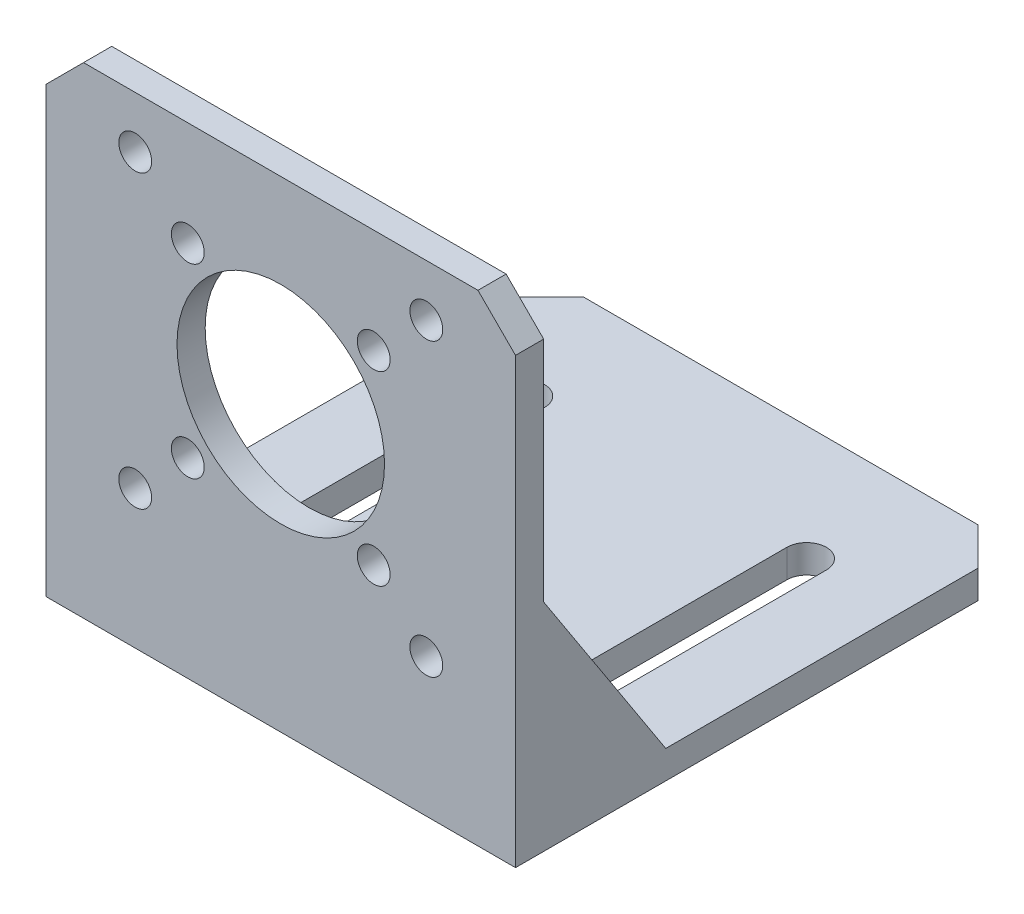
ISO-10303-21;
HEADER;
FILE_DESCRIPTION(('STEP AP214'),'2;1');
FILE_NAME('part.step','',(''),(''),'','','');
FILE_SCHEMA(('AUTOMOTIVE_DESIGN { 1 0 10303 214 1 1 1 1 }'));
ENDSEC;
DATA;
#1=APPLICATION_CONTEXT('core data for automotive mechanical design processes');
#2=APPLICATION_PROTOCOL_DEFINITION('international standard','automotive_design',2000,#1);
#3=PRODUCT_CONTEXT('',#1,'mechanical');
#4=PRODUCT('Part','Part','',(#3));
#5=PRODUCT_RELATED_PRODUCT_CATEGORY('part','',(#4));
#6=PRODUCT_DEFINITION_FORMATION('','',#4);
#7=PRODUCT_DEFINITION_CONTEXT('part definition',#1,'design');
#8=PRODUCT_DEFINITION('design','',#6,#7);
#9=PRODUCT_DEFINITION_SHAPE('','',#8);
#10=(LENGTH_UNIT() NAMED_UNIT(*) SI_UNIT(.MILLI.,.METRE.));
#11=(NAMED_UNIT(*) PLANE_ANGLE_UNIT() SI_UNIT($,.RADIAN.));
#12=(NAMED_UNIT(*) SI_UNIT($,.STERADIAN.) SOLID_ANGLE_UNIT());
#13=UNCERTAINTY_MEASURE_WITH_UNIT(LENGTH_MEASURE(1.E-05),#10,'distance_accuracy_value','');
#14=(GEOMETRIC_REPRESENTATION_CONTEXT(3) GLOBAL_UNCERTAINTY_ASSIGNED_CONTEXT((#13)) GLOBAL_UNIT_ASSIGNED_CONTEXT((#10,
#11,#12)) REPRESENTATION_CONTEXT('',''));
#15=CARTESIAN_POINT('',(0.,0.,0.));
#16=DIRECTION('',(0.,0.,1.));
#17=DIRECTION('',(1.,0.,0.));
#18=AXIS2_PLACEMENT_3D('',#15,#16,#17);
#19=CARTESIAN_POINT('',(25.,5.,-5.));
#20=DIRECTION('',(1.,0.,0.));
#21=DIRECTION('',(0.,0.,-1.));
#22=AXIS2_PLACEMENT_3D('',#19,#20,#21);
#23=CYLINDRICAL_SURFACE('',#22,2.);
#24=CARTESIAN_POINT('',(-22.,5.,-5.));
#25=DIRECTION('',(-1.,0.,0.));
#26=DIRECTION('',(0.,0.,1.));
#27=AXIS2_PLACEMENT_3D('',#24,#25,#26);
#28=CIRCLE('',#27,2.);
#29=CARTESIAN_POINT('',(-22.,5.,-3.));
#30=VERTEX_POINT('',#29);
#31=CARTESIAN_POINT('',(-22.,3.,-5.));
#32=VERTEX_POINT('',#31);
#33=EDGE_CURVE('E473',#30,#32,#28,.F.);
#34=ORIENTED_EDGE('',*,*,#33,.F.);
#35=DIRECTION('',(-1.,0.,0.));
#36=VECTOR('',#35,1.);
#37=CARTESIAN_POINT('',(-25.,5.,-3.));
#38=LINE('',#37,#36);
#39=CARTESIAN_POINT('',(22.,5.,-3.));
#40=VERTEX_POINT('',#39);
#41=EDGE_CURVE('E297',#40,#30,#38,.T.);
#42=ORIENTED_EDGE('',*,*,#41,.F.);
#43=CARTESIAN_POINT('',(22.,5.,-5.));
#44=DIRECTION('',(1.,0.,0.));
#45=DIRECTION('',(0.,0.,-1.));
#46=AXIS2_PLACEMENT_3D('',#43,#44,#45);
#47=CIRCLE('',#46,2.);
#48=CARTESIAN_POINT('',(22.,3.,-5.));
#49=VERTEX_POINT('',#48);
#50=EDGE_CURVE('E11',#49,#40,#47,.F.);
#51=ORIENTED_EDGE('',*,*,#50,.F.);
#52=DIRECTION('',(-1.,0.,0.));
#53=VECTOR('',#52,1.);
#54=CARTESIAN_POINT('',(25.,3.,-5.));
#55=LINE('',#54,#53);
#56=EDGE_CURVE('E42',#32,#49,#55,.F.);
#57=ORIENTED_EDGE('',*,*,#56,.F.);
#58=EDGE_LOOP('',(#34,#42,#51,#57));
#59=FACE_BOUND('',#58,.T.);
#60=ADVANCED_FACE('F35',(#59),#23,.F.);
#61=CARTESIAN_POINT('',(25.,0.,0.));
#62=DIRECTION('',(0.,1.,0.));
#63=DIRECTION('',(0.,0.,1.));
#64=AXIS2_PLACEMENT_3D('',#61,#62,#63);
#65=PLANE('',#64);
#66=DIRECTION('',(0.,0.,-1.));
#67=VECTOR('',#66,1.);
#68=CARTESIAN_POINT('',(-25.,0.,0.));
#69=LINE('',#68,#67);
#70=CARTESIAN_POINT('',(-25.,0.,0.));
#71=VERTEX_POINT('',#70);
#72=CARTESIAN_POINT('',(-25.,0.,-49.25));
#73=VERTEX_POINT('',#72);
#74=EDGE_CURVE('E218',#71,#73,#69,.T.);
#75=ORIENTED_EDGE('',*,*,#74,.T.);
#76=DIRECTION('',(-0.707106781186546,0.,0.707106781186549));
#77=VECTOR('',#76,1.);
#78=CARTESIAN_POINT('',(-25.,0.,-49.25));
#79=LINE('',#78,#77);
#80=CARTESIAN_POINT('',(-21.,0.,-53.25));
#81=VERTEX_POINT('',#80);
#82=EDGE_CURVE('E242',#73,#81,#79,.F.);
#83=ORIENTED_EDGE('',*,*,#82,.T.);
#84=DIRECTION('',(-1.,0.,0.));
#85=VECTOR('',#84,1.);
#86=CARTESIAN_POINT('',(25.,0.,-53.25));
#87=LINE('',#86,#85);
#88=CARTESIAN_POINT('',(21.,0.,-53.25));
#89=VERTEX_POINT('',#88);
#90=EDGE_CURVE('E234',#89,#81,#87,.T.);
#91=ORIENTED_EDGE('',*,*,#90,.F.);
#92=DIRECTION('',(0.707106781186549,0.,0.707106781186546));
#93=VECTOR('',#92,1.);
#94=CARTESIAN_POINT('',(21.,0.,-53.25));
#95=LINE('',#94,#93);
#96=CARTESIAN_POINT('',(25.,0.,-49.25));
#97=VERTEX_POINT('',#96);
#98=EDGE_CURVE('E244',#89,#97,#95,.T.);
#99=ORIENTED_EDGE('',*,*,#98,.T.);
#100=DIRECTION('',(0.,0.,-1.));
#101=VECTOR('',#100,1.);
#102=CARTESIAN_POINT('',(25.,0.,0.));
#103=LINE('',#102,#101);
#104=CARTESIAN_POINT('',(25.,0.,0.));
#105=VERTEX_POINT('',#104);
#106=EDGE_CURVE('E216',#105,#97,#103,.T.);
#107=ORIENTED_EDGE('',*,*,#106,.F.);
#108=DIRECTION('',(-1.,0.,0.));
#109=VECTOR('',#108,1.);
#110=CARTESIAN_POINT('',(25.,0.,0.));
#111=LINE('',#110,#109);
#112=EDGE_CURVE('E222',#105,#71,#111,.T.);
#113=ORIENTED_EDGE('',*,*,#112,.T.);
#114=EDGE_LOOP('',(#75,#83,#91,#99,#107,#113));
#115=FACE_BOUND('',#114,.T.);
#116=CARTESIAN_POINT('',(15.,0.,-41.));
#117=DIRECTION('',(0.,1.,0.));
#118=DIRECTION('',(0.,0.,-1.));
#119=AXIS2_PLACEMENT_3D('',#116,#117,#118);
#120=CIRCLE('',#119,2.1);
#121=CARTESIAN_POINT('',(17.1,0.,-41.));
#122=VERTEX_POINT('',#121);
#123=CARTESIAN_POINT('',(12.9,0.,-41.));
#124=VERTEX_POINT('',#123);
#125=EDGE_CURVE('E324',#122,#124,#120,.T.);
#126=ORIENTED_EDGE('',*,*,#125,.T.);
#127=DIRECTION('',(0.,0.,1.));
#128=VECTOR('',#127,1.);
#129=CARTESIAN_POINT('',(12.9,0.,-41.));
#130=LINE('',#129,#128);
#131=CARTESIAN_POINT('',(12.9,0.,-11.));
#132=VERTEX_POINT('',#131);
#133=EDGE_CURVE('E350',#124,#132,#130,.T.);
#134=ORIENTED_EDGE('',*,*,#133,.T.);
#135=CARTESIAN_POINT('',(15.,0.,-11.));
#136=DIRECTION('',(0.,1.,0.));
#137=DIRECTION('',(0.,0.,-1.));
#138=AXIS2_PLACEMENT_3D('',#135,#136,#137);
#139=CIRCLE('',#138,2.1);
#140=CARTESIAN_POINT('',(17.1,0.,-11.));
#141=VERTEX_POINT('',#140);
#142=EDGE_CURVE('E353',#132,#141,#139,.T.);
#143=ORIENTED_EDGE('',*,*,#142,.T.);
#144=DIRECTION('',(0.,0.,-1.));
#145=VECTOR('',#144,1.);
#146=CARTESIAN_POINT('',(17.1,0.,-41.));
#147=LINE('',#146,#145);
#148=EDGE_CURVE('E356',#141,#122,#147,.T.);
#149=ORIENTED_EDGE('',*,*,#148,.T.);
#150=EDGE_LOOP('',(#126,#134,#143,#149));
#151=FACE_BOUND('',#150,.T.);
#152=CARTESIAN_POINT('',(-15.,0.,-41.));
#153=DIRECTION('',(0.,1.,0.));
#154=DIRECTION('',(0.,0.,1.));
#155=AXIS2_PLACEMENT_3D('',#152,#153,#154);
#156=CIRCLE('',#155,2.1);
#157=CARTESIAN_POINT('',(-12.9,0.,-41.));
#158=VERTEX_POINT('',#157);
#159=CARTESIAN_POINT('',(-17.1,0.,-41.));
#160=VERTEX_POINT('',#159);
#161=EDGE_CURVE('E325',#158,#160,#156,.T.);
#162=ORIENTED_EDGE('',*,*,#161,.T.);
#163=DIRECTION('',(0.,0.,1.));
#164=VECTOR('',#163,1.);
#165=CARTESIAN_POINT('',(-17.1,0.,-41.));
#166=LINE('',#165,#164);
#167=CARTESIAN_POINT('',(-17.1,0.,-11.));
#168=VERTEX_POINT('',#167);
#169=EDGE_CURVE('E328',#160,#168,#166,.T.);
#170=ORIENTED_EDGE('',*,*,#169,.T.);
#171=CARTESIAN_POINT('',(-15.,0.,-11.));
#172=DIRECTION('',(0.,1.,0.));
#173=DIRECTION('',(0.,0.,1.));
#174=AXIS2_PLACEMENT_3D('',#171,#172,#173);
#175=CIRCLE('',#174,2.1);
#176=CARTESIAN_POINT('',(-12.9,0.,-11.));
#177=VERTEX_POINT('',#176);
#178=EDGE_CURVE('E332',#168,#177,#175,.T.);
#179=ORIENTED_EDGE('',*,*,#178,.T.);
#180=DIRECTION('',(0.,0.,-1.));
#181=VECTOR('',#180,1.);
#182=CARTESIAN_POINT('',(-12.9,0.,-41.));
#183=LINE('',#182,#181);
#184=EDGE_CURVE('E335',#177,#158,#183,.T.);
#185=ORIENTED_EDGE('',*,*,#184,.T.);
#186=EDGE_LOOP('',(#162,#170,#179,#185));
#187=FACE_BOUND('',#186,.T.);
#188=ADVANCED_FACE('F428',(#115,#151,#187),#65,.F.);
#189=CARTESIAN_POINT('',(25.,3.,0.));
#190=DIRECTION('',(0.,1.,0.));
#191=DIRECTION('',(0.,0.,1.));
#192=AXIS2_PLACEMENT_3D('',#189,#190,#191);
#193=PLANE('',#192);
#194=DIRECTION('',(-1.,0.,0.));
#195=VECTOR('',#194,1.);
#196=CARTESIAN_POINT('',(25.,3.,-16.));
#197=LINE('',#196,#195);
#198=CARTESIAN_POINT('',(-22.,3.,-16.));
#199=VERTEX_POINT('',#198);
#200=CARTESIAN_POINT('',(-25.,3.,-16.));
#201=VERTEX_POINT('',#200);
#202=EDGE_CURVE('E193',#199,#201,#197,.T.);
#203=ORIENTED_EDGE('',*,*,#202,.F.);
#204=DIRECTION('',(0.,0.,1.));
#205=VECTOR('',#204,1.);
#206=CARTESIAN_POINT('',(-22.,3.,0.));
#207=LINE('',#206,#205);
#208=EDGE_CURVE('E303',#199,#32,#207,.T.);
#209=ORIENTED_EDGE('',*,*,#208,.T.);
#210=ORIENTED_EDGE('',*,*,#56,.T.);
#211=DIRECTION('',(0.,0.,-1.));
#212=VECTOR('',#211,1.);
#213=CARTESIAN_POINT('',(22.,3.,0.));
#214=LINE('',#213,#212);
#215=CARTESIAN_POINT('',(22.,3.,-16.));
#216=VERTEX_POINT('',#215);
#217=EDGE_CURVE('E57',#49,#216,#214,.T.);
#218=ORIENTED_EDGE('',*,*,#217,.T.);
#219=DIRECTION('',(1.,0.,0.));
#220=VECTOR('',#219,1.);
#221=CARTESIAN_POINT('',(25.,3.,-16.));
#222=LINE('',#221,#220);
#223=CARTESIAN_POINT('',(25.,3.,-16.));
#224=VERTEX_POINT('',#223);
#225=EDGE_CURVE('E317',#224,#216,#222,.F.);
#226=ORIENTED_EDGE('',*,*,#225,.F.);
#227=DIRECTION('',(0.,0.,-1.));
#228=VECTOR('',#227,1.);
#229=CARTESIAN_POINT('',(25.,3.,0.));
#230=LINE('',#229,#228);
#231=CARTESIAN_POINT('',(25.,3.,-49.25));
#232=VERTEX_POINT('',#231);
#233=EDGE_CURVE('E421',#224,#232,#230,.T.);
#234=ORIENTED_EDGE('',*,*,#233,.T.);
#235=DIRECTION('',(-0.707106781186549,0.,-0.707106781186546));
#236=VECTOR('',#235,1.);
#237=CARTESIAN_POINT('',(49.625,3.,-24.6250000000001));
#238=LINE('',#237,#236);
#239=CARTESIAN_POINT('',(21.,3.,-53.25));
#240=VERTEX_POINT('',#239);
#241=EDGE_CURVE('E255',#232,#240,#238,.T.);
#242=ORIENTED_EDGE('',*,*,#241,.T.);
#243=DIRECTION('',(-1.,0.,0.));
#244=VECTOR('',#243,1.);
#245=CARTESIAN_POINT('',(25.,3.,-53.25));
#246=LINE('',#245,#244);
#247=CARTESIAN_POINT('',(-21.,3.,-53.25));
#248=VERTEX_POINT('',#247);
#249=EDGE_CURVE('E231',#240,#248,#246,.T.);
#250=ORIENTED_EDGE('',*,*,#249,.T.);
#251=DIRECTION('',(0.707106781186546,0.,-0.707106781186549));
#252=VECTOR('',#251,1.);
#253=CARTESIAN_POINT('',(-24.6250000000001,3.,-49.6249999999999));
#254=LINE('',#253,#252);
#255=CARTESIAN_POINT('',(-25.,3.,-49.25));
#256=VERTEX_POINT('',#255);
#257=EDGE_CURVE('E252',#248,#256,#254,.F.);
#258=ORIENTED_EDGE('',*,*,#257,.T.);
#259=DIRECTION('',(0.,0.,-1.));
#260=VECTOR('',#259,1.);
#261=CARTESIAN_POINT('',(-25.,3.,0.));
#262=LINE('',#261,#260);
#263=EDGE_CURVE('E213',#201,#256,#262,.T.);
#264=ORIENTED_EDGE('',*,*,#263,.F.);
#265=EDGE_LOOP('',(#203,#209,#210,#218,#226,#234,#242,#250,#258,#264));
#266=FACE_BOUND('',#265,.T.);
#267=DIRECTION('',(0.,0.,-1.));
#268=VECTOR('',#267,1.);
#269=CARTESIAN_POINT('',(12.9,3.,0.));
#270=LINE('',#269,#268);
#271=CARTESIAN_POINT('',(12.9,3.00000000000002,-11.));
#272=VERTEX_POINT('',#271);
#273=CARTESIAN_POINT('',(12.9,3.00000000000002,-41.));
#274=VERTEX_POINT('',#273);
#275=EDGE_CURVE('E279',#272,#274,#270,.T.);
#276=ORIENTED_EDGE('',*,*,#275,.T.);
#277=CARTESIAN_POINT('',(15.,3.,-41.));
#278=DIRECTION('',(0.,1.,0.));
#279=DIRECTION('',(0.,0.,1.));
#280=AXIS2_PLACEMENT_3D('',#277,#278,#279);
#281=CIRCLE('',#280,2.1);
#282=CARTESIAN_POINT('',(17.1,3.00000000000002,-41.));
#283=VERTEX_POINT('',#282);
#284=EDGE_CURVE('E282',#274,#283,#281,.F.);
#285=ORIENTED_EDGE('',*,*,#284,.T.);
#286=DIRECTION('',(0.,0.,1.));
#287=VECTOR('',#286,1.);
#288=CARTESIAN_POINT('',(17.1,3.,0.));
#289=LINE('',#288,#287);
#290=CARTESIAN_POINT('',(17.1,3.,-11.));
#291=VERTEX_POINT('',#290);
#292=EDGE_CURVE('E273',#283,#291,#289,.T.);
#293=ORIENTED_EDGE('',*,*,#292,.T.);
#294=CARTESIAN_POINT('',(15.,3.,-11.));
#295=DIRECTION('',(0.,1.,0.));
#296=DIRECTION('',(0.,0.,1.));
#297=AXIS2_PLACEMENT_3D('',#294,#295,#296);
#298=CIRCLE('',#297,2.1);
#299=EDGE_CURVE('E276',#291,#272,#298,.F.);
#300=ORIENTED_EDGE('',*,*,#299,.T.);
#301=EDGE_LOOP('',(#276,#285,#293,#300));
#302=FACE_BOUND('',#301,.T.);
#303=DIRECTION('',(0.,0.,-1.));
#304=VECTOR('',#303,1.);
#305=CARTESIAN_POINT('',(-17.1,3.,0.));
#306=LINE('',#305,#304);
#307=CARTESIAN_POINT('',(-17.1,3.00000000000002,-11.));
#308=VERTEX_POINT('',#307);
#309=CARTESIAN_POINT('',(-17.1,3.00000000000002,-41.));
#310=VERTEX_POINT('',#309);
#311=EDGE_CURVE('E291',#308,#310,#306,.T.);
#312=ORIENTED_EDGE('',*,*,#311,.T.);
#313=CARTESIAN_POINT('',(-15.,3.,-41.));
#314=DIRECTION('',(0.,1.,0.));
#315=DIRECTION('',(0.,0.,1.));
#316=AXIS2_PLACEMENT_3D('',#313,#314,#315);
#317=CIRCLE('',#316,2.1);
#318=CARTESIAN_POINT('',(-12.9,3.00000000000002,-41.));
#319=VERTEX_POINT('',#318);
#320=EDGE_CURVE('E294',#310,#319,#317,.F.);
#321=ORIENTED_EDGE('',*,*,#320,.T.);
#322=DIRECTION('',(0.,0.,1.));
#323=VECTOR('',#322,1.);
#324=CARTESIAN_POINT('',(-12.9,3.,0.));
#325=LINE('',#324,#323);
#326=CARTESIAN_POINT('',(-12.9,3.,-11.));
#327=VERTEX_POINT('',#326);
#328=EDGE_CURVE('E285',#319,#327,#325,.T.);
#329=ORIENTED_EDGE('',*,*,#328,.T.);
#330=CARTESIAN_POINT('',(-15.,3.,-11.));
#331=DIRECTION('',(0.,1.,0.));
#332=DIRECTION('',(0.,0.,1.));
#333=AXIS2_PLACEMENT_3D('',#330,#331,#332);
#334=CIRCLE('',#333,2.1);
#335=EDGE_CURVE('E288',#327,#308,#334,.F.);
#336=ORIENTED_EDGE('',*,*,#335,.T.);
#337=EDGE_LOOP('',(#312,#321,#329,#336));
#338=FACE_BOUND('',#337,.T.);
#339=ADVANCED_FACE('F301',(#266,#302,#338),#193,.T.);
#340=CARTESIAN_POINT('',(25.,3.,-53.25));
#341=DIRECTION('',(0.,0.,-1.));
#342=DIRECTION('',(-1.,0.,0.));
#343=AXIS2_PLACEMENT_3D('',#340,#341,#342);
#344=PLANE('',#343);
#345=ORIENTED_EDGE('',*,*,#249,.F.);
#346=DIRECTION('',(0.,-1.,0.));
#347=VECTOR('',#346,1.);
#348=CARTESIAN_POINT('',(21.,0.,-53.25));
#349=LINE('',#348,#347);
#350=EDGE_CURVE('E239',#240,#89,#349,.T.);
#351=ORIENTED_EDGE('',*,*,#350,.T.);
#352=ORIENTED_EDGE('',*,*,#90,.T.);
#353=DIRECTION('',(0.,1.,0.));
#354=VECTOR('',#353,1.);
#355=CARTESIAN_POINT('',(-21.,3.,-53.25));
#356=LINE('',#355,#354);
#357=EDGE_CURVE('E237',#81,#248,#356,.T.);
#358=ORIENTED_EDGE('',*,*,#357,.T.);
#359=EDGE_LOOP('',(#345,#351,#352,#358));
#360=FACE_BOUND('',#359,.T.);
#361=ADVANCED_FACE('F442',(#360),#344,.T.);
#362=CARTESIAN_POINT('',(25.,51.25,-3.));
#363=DIRECTION('',(0.,0.,-1.));
#364=DIRECTION('',(0.,1.,0.));
#365=AXIS2_PLACEMENT_3D('',#362,#363,#364);
#366=PLANE('',#365);
#367=DIRECTION('',(1.,0.,0.));
#368=VECTOR('',#367,1.);
#369=CARTESIAN_POINT('',(25.,23.,-3.));
#370=LINE('',#369,#368);
#371=CARTESIAN_POINT('',(-25.,23.,-3.00000000000001));
#372=VERTEX_POINT('',#371);
#373=CARTESIAN_POINT('',(-22.,23.,-3.));
#374=VERTEX_POINT('',#373);
#375=EDGE_CURVE('E190',#372,#374,#370,.T.);
#376=ORIENTED_EDGE('',*,*,#375,.F.);
#377=DIRECTION('',(0.,-1.,0.));
#378=VECTOR('',#377,1.);
#379=CARTESIAN_POINT('',(-25.,51.25,-3.));
#380=LINE('',#379,#378);
#381=CARTESIAN_POINT('',(-25.,47.25,-3.));
#382=VERTEX_POINT('',#381);
#383=EDGE_CURVE('E202',#382,#372,#380,.T.);
#384=ORIENTED_EDGE('',*,*,#383,.F.);
#385=DIRECTION('',(-0.707106781186546,-0.707106781186549,0.));
#386=VECTOR('',#385,1.);
#387=CARTESIAN_POINT('',(1.99999999999991,74.25,-3.));
#388=LINE('',#387,#386);
#389=CARTESIAN_POINT('',(-21.,51.25,-3.));
#390=VERTEX_POINT('',#389);
#391=EDGE_CURVE('E262',#382,#390,#388,.F.);
#392=ORIENTED_EDGE('',*,*,#391,.T.);
#393=DIRECTION('',(-1.,0.,0.));
#394=VECTOR('',#393,1.);
#395=CARTESIAN_POINT('',(25.,51.25,-3.));
#396=LINE('',#395,#394);
#397=CARTESIAN_POINT('',(21.,51.25,-3.));
#398=VERTEX_POINT('',#397);
#399=EDGE_CURVE('E228',#398,#390,#396,.T.);
#400=ORIENTED_EDGE('',*,*,#399,.F.);
#401=DIRECTION('',(0.707106781186549,-0.707106781186546,0.));
#402=VECTOR('',#401,1.);
#403=CARTESIAN_POINT('',(23.,49.25,-3.));
#404=LINE('',#403,#402);
#405=CARTESIAN_POINT('',(25.,47.25,-3.));
#406=VERTEX_POINT('',#405);
#407=EDGE_CURVE('E260',#398,#406,#404,.T.);
#408=ORIENTED_EDGE('',*,*,#407,.T.);
#409=DIRECTION('',(0.,-1.,0.));
#410=VECTOR('',#409,1.);
#411=CARTESIAN_POINT('',(25.,51.25,-3.));
#412=LINE('',#411,#410);
#413=CARTESIAN_POINT('',(25.,23.,-3.00000000000001));
#414=VERTEX_POINT('',#413);
#415=EDGE_CURVE('E423',#406,#414,#412,.T.);
#416=ORIENTED_EDGE('',*,*,#415,.T.);
#417=DIRECTION('',(-1.,0.,0.));
#418=VECTOR('',#417,1.);
#419=CARTESIAN_POINT('',(25.,23.,-3.));
#420=LINE('',#419,#418);
#421=CARTESIAN_POINT('',(22.,23.,-3.));
#422=VERTEX_POINT('',#421);
#423=EDGE_CURVE('E313',#422,#414,#420,.F.);
#424=ORIENTED_EDGE('',*,*,#423,.F.);
#425=DIRECTION('',(0.,-1.,0.));
#426=VECTOR('',#425,1.);
#427=CARTESIAN_POINT('',(22.,51.25,-3.));
#428=LINE('',#427,#426);
#429=EDGE_CURVE('E314',#422,#40,#428,.T.);
#430=ORIENTED_EDGE('',*,*,#429,.T.);
#431=ORIENTED_EDGE('',*,*,#41,.T.);
#432=DIRECTION('',(0.,1.,0.));
#433=VECTOR('',#432,1.);
#434=CARTESIAN_POINT('',(-22.,51.25,-3.));
#435=LINE('',#434,#433);
#436=EDGE_CURVE('E204',#30,#374,#435,.T.);
#437=ORIENTED_EDGE('',*,*,#436,.T.);
#438=EDGE_LOOP('',(#376,#384,#392,#400,#408,#416,#424,#430,#431,#437));
#439=FACE_BOUND('',#438,.T.);
#440=CARTESIAN_POINT('',(-15.5,14.75,-3.));
#441=DIRECTION('',(0.,0.,-1.));
#442=DIRECTION('',(0.,1.,0.));
#443=AXIS2_PLACEMENT_3D('',#440,#441,#442);
#444=CIRCLE('',#443,1.75);
#445=CARTESIAN_POINT('',(-15.5,16.5,-3.));
#446=VERTEX_POINT('',#445);
#447=EDGE_CURVE('E417',#446,#446,#444,.T.);
#448=ORIENTED_EDGE('',*,*,#447,.F.);
#449=EDGE_LOOP('',(#448));
#450=FACE_BOUND('',#449,.T.);
#451=CARTESIAN_POINT('',(-9.8989898474541,20.35,-3.));
#452=DIRECTION('',(0.,0.,-1.));
#453=DIRECTION('',(0.,1.,0.));
#454=AXIS2_PLACEMENT_3D('',#451,#452,#453);
#455=CIRCLE('',#454,1.75);
#456=CARTESIAN_POINT('',(-9.8989898474541,22.1,-3.));
#457=VERTEX_POINT('',#456);
#458=EDGE_CURVE('E414',#457,#457,#455,.T.);
#459=ORIENTED_EDGE('',*,*,#458,.F.);
#460=EDGE_LOOP('',(#459));
#461=FACE_BOUND('',#460,.T.);
#462=CARTESIAN_POINT('',(9.89898984745415,20.35,-3.));
#463=DIRECTION('',(0.,0.,-1.));
#464=DIRECTION('',(0.,1.,0.));
#465=AXIS2_PLACEMENT_3D('',#462,#463,#464);
#466=CIRCLE('',#465,1.74999999999999);
#467=CARTESIAN_POINT('',(9.89898984745415,22.1,-3.));
#468=VERTEX_POINT('',#467);
#469=EDGE_CURVE('E411',#468,#468,#466,.T.);
#470=ORIENTED_EDGE('',*,*,#469,.F.);
#471=EDGE_LOOP('',(#470));
#472=FACE_BOUND('',#471,.T.);
#473=CARTESIAN_POINT('',(15.5,14.75,-3.));
#474=DIRECTION('',(0.,0.,-1.));
#475=DIRECTION('',(0.,1.,0.));
#476=AXIS2_PLACEMENT_3D('',#473,#474,#475);
#477=CIRCLE('',#476,1.75);
#478=CARTESIAN_POINT('',(15.5,16.5,-3.));
#479=VERTEX_POINT('',#478);
#480=EDGE_CURVE('E408',#479,#479,#477,.T.);
#481=ORIENTED_EDGE('',*,*,#480,.F.);
#482=EDGE_LOOP('',(#481));
#483=FACE_BOUND('',#482,.T.);
#484=CARTESIAN_POINT('',(15.5,45.75,-3.));
#485=DIRECTION('',(0.,0.,-1.));
#486=DIRECTION('',(0.,1.,0.));
#487=AXIS2_PLACEMENT_3D('',#484,#485,#486);
#488=CIRCLE('',#487,1.75);
#489=CARTESIAN_POINT('',(15.5,47.5,-3.));
#490=VERTEX_POINT('',#489);
#491=EDGE_CURVE('E405',#490,#490,#488,.T.);
#492=ORIENTED_EDGE('',*,*,#491,.F.);
#493=EDGE_LOOP('',(#492));
#494=FACE_BOUND('',#493,.T.);
#495=CARTESIAN_POINT('',(9.89898984745414,40.15,-3.));
#496=DIRECTION('',(0.,0.,-1.));
#497=DIRECTION('',(0.,1.,0.));
#498=AXIS2_PLACEMENT_3D('',#495,#496,#497);
#499=CIRCLE('',#498,1.75);
#500=CARTESIAN_POINT('',(9.89898984745414,41.9,-3.));
#501=VERTEX_POINT('',#500);
#502=EDGE_CURVE('E402',#501,#501,#499,.T.);
#503=ORIENTED_EDGE('',*,*,#502,.F.);
#504=EDGE_LOOP('',(#503));
#505=FACE_BOUND('',#504,.T.);
#506=CARTESIAN_POINT('',(-15.5,45.75,-3.));
#507=DIRECTION('',(0.,0.,-1.));
#508=DIRECTION('',(0.,1.,0.));
#509=AXIS2_PLACEMENT_3D('',#506,#507,#508);
#510=CIRCLE('',#509,1.75);
#511=CARTESIAN_POINT('',(-15.5,47.5,-3.));
#512=VERTEX_POINT('',#511);
#513=EDGE_CURVE('E399',#512,#512,#510,.T.);
#514=ORIENTED_EDGE('',*,*,#513,.F.);
#515=EDGE_LOOP('',(#514));
#516=FACE_BOUND('',#515,.T.);
#517=CARTESIAN_POINT('',(-9.89898984745413,40.15,-3.));
#518=DIRECTION('',(0.,0.,-1.));
#519=DIRECTION('',(0.,1.,0.));
#520=AXIS2_PLACEMENT_3D('',#517,#518,#519);
#521=CIRCLE('',#520,1.75);
#522=CARTESIAN_POINT('',(-9.89898984745413,41.9,-3.));
#523=VERTEX_POINT('',#522);
#524=EDGE_CURVE('E396',#523,#523,#521,.T.);
#525=ORIENTED_EDGE('',*,*,#524,.F.);
#526=EDGE_LOOP('',(#525));
#527=FACE_BOUND('',#526,.T.);
#528=CARTESIAN_POINT('',(0.,30.25,-3.));
#529=DIRECTION('',(0.,0.,-1.));
#530=DIRECTION('',(0.,1.,0.));
#531=AXIS2_PLACEMENT_3D('',#528,#529,#530);
#532=CIRCLE('',#531,11.05);
#533=CARTESIAN_POINT('',(0.,41.3,-3.));
#534=VERTEX_POINT('',#533);
#535=EDGE_CURVE('E393',#534,#534,#532,.T.);
#536=ORIENTED_EDGE('',*,*,#535,.F.);
#537=EDGE_LOOP('',(#536));
#538=FACE_BOUND('',#537,.T.);
#539=ADVANCED_FACE('F200',(#439,#450,#461,#472,#483,#494,#505,#516,#527,#538),#366,.T.);
#540=CARTESIAN_POINT('',(25.,51.25,0.));
#541=DIRECTION('',(0.,1.,0.));
#542=DIRECTION('',(0.,0.,1.));
#543=AXIS2_PLACEMENT_3D('',#540,#541,#542);
#544=PLANE('',#543);
#545=ORIENTED_EDGE('',*,*,#399,.T.);
#546=DIRECTION('',(0.,0.,1.));
#547=VECTOR('',#546,1.);
#548=CARTESIAN_POINT('',(-21.,51.25,0.));
#549=LINE('',#548,#547);
#550=CARTESIAN_POINT('',(-21.,51.25,0.));
#551=VERTEX_POINT('',#550);
#552=EDGE_CURVE('E267',#390,#551,#549,.T.);
#553=ORIENTED_EDGE('',*,*,#552,.T.);
#554=DIRECTION('',(-1.,0.,0.));
#555=VECTOR('',#554,1.);
#556=CARTESIAN_POINT('',(25.,51.25,0.));
#557=LINE('',#556,#555);
#558=CARTESIAN_POINT('',(21.,51.25,0.));
#559=VERTEX_POINT('',#558);
#560=EDGE_CURVE('E224',#559,#551,#557,.T.);
#561=ORIENTED_EDGE('',*,*,#560,.F.);
#562=DIRECTION('',(0.,0.,-1.));
#563=VECTOR('',#562,1.);
#564=CARTESIAN_POINT('',(21.,51.25,-3.));
#565=LINE('',#564,#563);
#566=EDGE_CURVE('E264',#559,#398,#565,.T.);
#567=ORIENTED_EDGE('',*,*,#566,.T.);
#568=EDGE_LOOP('',(#545,#553,#561,#567));
#569=FACE_BOUND('',#568,.T.);
#570=ADVANCED_FACE('F462',(#569),#544,.T.);
#571=CARTESIAN_POINT('',(25.,51.25,0.));
#572=DIRECTION('',(0.,0.,-1.));
#573=DIRECTION('',(0.,1.,0.));
#574=AXIS2_PLACEMENT_3D('',#571,#572,#573);
#575=PLANE('',#574);
#576=DIRECTION('',(0.,-1.,0.));
#577=VECTOR('',#576,1.);
#578=CARTESIAN_POINT('',(-25.,51.25,0.));
#579=LINE('',#578,#577);
#580=CARTESIAN_POINT('',(-25.,47.25,0.));
#581=VERTEX_POINT('',#580);
#582=EDGE_CURVE('E212',#581,#71,#579,.T.);
#583=ORIENTED_EDGE('',*,*,#582,.T.);
#584=ORIENTED_EDGE('',*,*,#112,.F.);
#585=DIRECTION('',(0.,-1.,0.));
#586=VECTOR('',#585,1.);
#587=CARTESIAN_POINT('',(25.,51.25,0.));
#588=LINE('',#587,#586);
#589=CARTESIAN_POINT('',(25.,47.25,0.));
#590=VERTEX_POINT('',#589);
#591=EDGE_CURVE('E225',#590,#105,#588,.T.);
#592=ORIENTED_EDGE('',*,*,#591,.F.);
#593=DIRECTION('',(-0.707106781186549,0.707106781186546,0.));
#594=VECTOR('',#593,1.);
#595=CARTESIAN_POINT('',(21.,51.25,0.));
#596=LINE('',#595,#594);
#597=EDGE_CURVE('E269',#590,#559,#596,.T.);
#598=ORIENTED_EDGE('',*,*,#597,.T.);
#599=ORIENTED_EDGE('',*,*,#560,.T.);
#600=DIRECTION('',(0.707106781186546,0.707106781186549,0.));
#601=VECTOR('',#600,1.);
#602=CARTESIAN_POINT('',(-25.,47.25,0.));
#603=LINE('',#602,#601);
#604=EDGE_CURVE('E271',#551,#581,#603,.F.);
#605=ORIENTED_EDGE('',*,*,#604,.T.);
#606=EDGE_LOOP('',(#583,#584,#592,#598,#599,#605));
#607=FACE_BOUND('',#606,.T.);
#608=CARTESIAN_POINT('',(-15.5,14.75,0.));
#609=DIRECTION('',(0.,0.,1.));
#610=DIRECTION('',(-1.,0.,0.));
#611=AXIS2_PLACEMENT_3D('',#608,#609,#610);
#612=CIRCLE('',#611,1.75);
#613=CARTESIAN_POINT('',(-17.25,14.75,0.));
#614=VERTEX_POINT('',#613);
#615=EDGE_CURVE('E347',#614,#614,#612,.T.);
#616=ORIENTED_EDGE('',*,*,#615,.F.);
#617=EDGE_LOOP('',(#616));
#618=FACE_BOUND('',#617,.T.);
#619=CARTESIAN_POINT('',(-9.8989898474541,20.35,0.));
#620=DIRECTION('',(0.,0.,1.));
#621=DIRECTION('',(-1.,0.,0.));
#622=AXIS2_PLACEMENT_3D('',#619,#620,#621);
#623=CIRCLE('',#622,1.75);
#624=CARTESIAN_POINT('',(-11.6489898474541,20.35,0.));
#625=VERTEX_POINT('',#624);
#626=EDGE_CURVE('E386',#625,#625,#623,.T.);
#627=ORIENTED_EDGE('',*,*,#626,.F.);
#628=EDGE_LOOP('',(#627));
#629=FACE_BOUND('',#628,.T.);
#630=CARTESIAN_POINT('',(9.89898984745415,20.35,0.));
#631=DIRECTION('',(0.,0.,1.));
#632=DIRECTION('',(1.,0.,0.));
#633=AXIS2_PLACEMENT_3D('',#630,#631,#632);
#634=CIRCLE('',#633,1.74999999999999);
#635=CARTESIAN_POINT('',(11.6489898474541,20.35,0.));
#636=VERTEX_POINT('',#635);
#637=EDGE_CURVE('E383',#636,#636,#634,.T.);
#638=ORIENTED_EDGE('',*,*,#637,.F.);
#639=EDGE_LOOP('',(#638));
#640=FACE_BOUND('',#639,.T.);
#641=CARTESIAN_POINT('',(15.5,14.75,0.));
#642=DIRECTION('',(0.,0.,1.));
#643=DIRECTION('',(1.,0.,0.));
#644=AXIS2_PLACEMENT_3D('',#641,#642,#643);
#645=CIRCLE('',#644,1.75);
#646=CARTESIAN_POINT('',(17.25,14.75,0.));
#647=VERTEX_POINT('',#646);
#648=EDGE_CURVE('E380',#647,#647,#645,.T.);
#649=ORIENTED_EDGE('',*,*,#648,.F.);
#650=EDGE_LOOP('',(#649));
#651=FACE_BOUND('',#650,.T.);
#652=CARTESIAN_POINT('',(15.5,45.75,0.));
#653=DIRECTION('',(0.,0.,1.));
#654=DIRECTION('',(-1.,0.,0.));
#655=AXIS2_PLACEMENT_3D('',#652,#653,#654);
#656=CIRCLE('',#655,1.75);
#657=CARTESIAN_POINT('',(13.75,45.75,0.));
#658=VERTEX_POINT('',#657);
#659=EDGE_CURVE('E377',#658,#658,#656,.T.);
#660=ORIENTED_EDGE('',*,*,#659,.F.);
#661=EDGE_LOOP('',(#660));
#662=FACE_BOUND('',#661,.T.);
#663=CARTESIAN_POINT('',(9.89898984745414,40.15,0.));
#664=DIRECTION('',(0.,0.,1.));
#665=DIRECTION('',(-1.,0.,0.));
#666=AXIS2_PLACEMENT_3D('',#663,#664,#665);
#667=CIRCLE('',#666,1.75);
#668=CARTESIAN_POINT('',(8.14898984745414,40.15,0.));
#669=VERTEX_POINT('',#668);
#670=EDGE_CURVE('E374',#669,#669,#667,.T.);
#671=ORIENTED_EDGE('',*,*,#670,.F.);
#672=EDGE_LOOP('',(#671));
#673=FACE_BOUND('',#672,.T.);
#674=CARTESIAN_POINT('',(-15.5,45.75,0.));
#675=DIRECTION('',(0.,0.,1.));
#676=DIRECTION('',(1.,0.,0.));
#677=AXIS2_PLACEMENT_3D('',#674,#675,#676);
#678=CIRCLE('',#677,1.75);
#679=CARTESIAN_POINT('',(-13.75,45.75,0.));
#680=VERTEX_POINT('',#679);
#681=EDGE_CURVE('E371',#680,#680,#678,.T.);
#682=ORIENTED_EDGE('',*,*,#681,.F.);
#683=EDGE_LOOP('',(#682));
#684=FACE_BOUND('',#683,.T.);
#685=CARTESIAN_POINT('',(-9.89898984745413,40.15,0.));
#686=DIRECTION('',(0.,0.,1.));
#687=DIRECTION('',(1.,0.,0.));
#688=AXIS2_PLACEMENT_3D('',#685,#686,#687);
#689=CIRCLE('',#688,1.75);
#690=CARTESIAN_POINT('',(-8.14898984745413,40.15,0.));
#691=VERTEX_POINT('',#690);
#692=EDGE_CURVE('E367',#691,#691,#689,.T.);
#693=ORIENTED_EDGE('',*,*,#692,.F.);
#694=EDGE_LOOP('',(#693));
#695=FACE_BOUND('',#694,.T.);
#696=CARTESIAN_POINT('',(0.,30.25,0.));
#697=DIRECTION('',(0.,0.,1.));
#698=DIRECTION('',(1.,0.,0.));
#699=AXIS2_PLACEMENT_3D('',#696,#697,#698);
#700=CIRCLE('',#699,11.05);
#701=CARTESIAN_POINT('',(11.05,30.25,0.));
#702=VERTEX_POINT('',#701);
#703=EDGE_CURVE('E370',#702,#702,#700,.T.);
#704=ORIENTED_EDGE('',*,*,#703,.F.);
#705=EDGE_LOOP('',(#704));
#706=FACE_BOUND('',#705,.T.);
#707=ADVANCED_FACE('F454',(#607,#618,#629,#640,#651,#662,#673,#684,#695,#706),#575,.F.);
#708=CARTESIAN_POINT('',(25.,0.,0.));
#709=DIRECTION('',(-1.,0.,0.));
#710=DIRECTION('',(0.,0.,1.));
#711=AXIS2_PLACEMENT_3D('',#708,#709,#710);
#712=PLANE('',#711);
#713=ORIENTED_EDGE('',*,*,#233,.F.);
#714=DIRECTION('',(0.,-0.838443616300637,-0.544988350595414));
#715=VECTOR('',#714,1.);
#716=CARTESIAN_POINT('',(25.,23.,-3.));
#717=LINE('',#716,#715);
#718=EDGE_CURVE('E319',#414,#224,#717,.T.);
#719=ORIENTED_EDGE('',*,*,#718,.F.);
#720=ORIENTED_EDGE('',*,*,#415,.F.);
#721=DIRECTION('',(0.,0.,1.));
#722=VECTOR('',#721,1.);
#723=CARTESIAN_POINT('',(25.,47.25,0.));
#724=LINE('',#723,#722);
#725=EDGE_CURVE('E247',#406,#590,#724,.T.);
#726=ORIENTED_EDGE('',*,*,#725,.T.);
#727=ORIENTED_EDGE('',*,*,#591,.T.);
#728=ORIENTED_EDGE('',*,*,#106,.T.);
#729=DIRECTION('',(0.,1.,0.));
#730=VECTOR('',#729,1.);
#731=CARTESIAN_POINT('',(25.,3.,-49.25));
#732=LINE('',#731,#730);
#733=EDGE_CURVE('E249',#97,#232,#732,.T.);
#734=ORIENTED_EDGE('',*,*,#733,.T.);
#735=EDGE_LOOP('',(#713,#719,#720,#726,#727,#728,#734));
#736=FACE_BOUND('',#735,.T.);
#737=ADVANCED_FACE('F448',(#736),#712,.F.);
#738=CARTESIAN_POINT('',(-25.,0.,0.));
#739=DIRECTION('',(-1.,0.,0.));
#740=DIRECTION('',(0.,0.,1.));
#741=AXIS2_PLACEMENT_3D('',#738,#739,#740);
#742=PLANE('',#741);
#743=DIRECTION('',(0.,-1.,0.));
#744=VECTOR('',#743,1.);
#745=CARTESIAN_POINT('',(-25.,0.,-49.25));
#746=LINE('',#745,#744);
#747=EDGE_CURVE('E258',#256,#73,#746,.T.);
#748=ORIENTED_EDGE('',*,*,#747,.T.);
#749=ORIENTED_EDGE('',*,*,#74,.F.);
#750=ORIENTED_EDGE('',*,*,#582,.F.);
#751=DIRECTION('',(0.,0.,-1.));
#752=VECTOR('',#751,1.);
#753=CARTESIAN_POINT('',(-25.,47.25,0.));
#754=LINE('',#753,#752);
#755=EDGE_CURVE('E211',#581,#382,#754,.T.);
#756=ORIENTED_EDGE('',*,*,#755,.T.);
#757=ORIENTED_EDGE('',*,*,#383,.T.);
#758=DIRECTION('',(0.,-0.838443616300637,-0.544988350595414));
#759=VECTOR('',#758,1.);
#760=CARTESIAN_POINT('',(-25.,23.,-3.));
#761=LINE('',#760,#759);
#762=EDGE_CURVE('E49',#372,#201,#761,.T.);
#763=ORIENTED_EDGE('',*,*,#762,.T.);
#764=ORIENTED_EDGE('',*,*,#263,.T.);
#765=EDGE_LOOP('',(#748,#749,#750,#756,#757,#763,#764));
#766=FACE_BOUND('',#765,.T.);
#767=ADVANCED_FACE('F208',(#766),#742,.T.);
#768=CARTESIAN_POINT('',(0.,30.25,-53.25));
#769=DIRECTION('',(0.,0.,1.));
#770=DIRECTION('',(1.,0.,0.));
#771=AXIS2_PLACEMENT_3D('',#768,#769,#770);
#772=CYLINDRICAL_SURFACE('',#771,11.05);
#773=ORIENTED_EDGE('',*,*,#535,.T.);
#774=EDGE_LOOP('',(#773));
#775=FACE_BOUND('',#774,.T.);
#776=ORIENTED_EDGE('',*,*,#703,.T.);
#777=EDGE_LOOP('',(#776));
#778=FACE_BOUND('',#777,.T.);
#779=ADVANCED_FACE('F540',(#775,#778),#772,.F.);
#780=CARTESIAN_POINT('',(-9.89898984745413,40.15,-53.25));
#781=DIRECTION('',(0.,0.,1.));
#782=DIRECTION('',(1.,0.,0.));
#783=AXIS2_PLACEMENT_3D('',#780,#781,#782);
#784=CYLINDRICAL_SURFACE('',#783,1.75);
#785=ORIENTED_EDGE('',*,*,#524,.T.);
#786=EDGE_LOOP('',(#785));
#787=FACE_BOUND('',#786,.T.);
#788=ORIENTED_EDGE('',*,*,#692,.T.);
#789=EDGE_LOOP('',(#788));
#790=FACE_BOUND('',#789,.T.);
#791=ADVANCED_FACE('F536',(#787,#790),#784,.F.);
#792=CARTESIAN_POINT('',(-15.5,45.75,-53.25));
#793=DIRECTION('',(0.,0.,1.));
#794=DIRECTION('',(1.,0.,0.));
#795=AXIS2_PLACEMENT_3D('',#792,#793,#794);
#796=CYLINDRICAL_SURFACE('',#795,1.75);
#797=ORIENTED_EDGE('',*,*,#513,.T.);
#798=EDGE_LOOP('',(#797));
#799=FACE_BOUND('',#798,.T.);
#800=ORIENTED_EDGE('',*,*,#681,.T.);
#801=EDGE_LOOP('',(#800));
#802=FACE_BOUND('',#801,.T.);
#803=ADVANCED_FACE('F539',(#799,#802),#796,.F.);
#804=CARTESIAN_POINT('',(9.89898984745414,40.15,-53.25));
#805=DIRECTION('',(0.,0.,1.));
#806=DIRECTION('',(1.,0.,0.));
#807=AXIS2_PLACEMENT_3D('',#804,#805,#806);
#808=CYLINDRICAL_SURFACE('',#807,1.75);
#809=ORIENTED_EDGE('',*,*,#502,.T.);
#810=EDGE_LOOP('',(#809));
#811=FACE_BOUND('',#810,.T.);
#812=ORIENTED_EDGE('',*,*,#670,.T.);
#813=EDGE_LOOP('',(#812));
#814=FACE_BOUND('',#813,.T.);
#815=ADVANCED_FACE('F544',(#811,#814),#808,.F.);
#816=CARTESIAN_POINT('',(15.5,45.75,-53.25));
#817=DIRECTION('',(0.,0.,1.));
#818=DIRECTION('',(1.,0.,0.));
#819=AXIS2_PLACEMENT_3D('',#816,#817,#818);
#820=CYLINDRICAL_SURFACE('',#819,1.75);
#821=ORIENTED_EDGE('',*,*,#491,.T.);
#822=EDGE_LOOP('',(#821));
#823=FACE_BOUND('',#822,.T.);
#824=ORIENTED_EDGE('',*,*,#659,.T.);
#825=EDGE_LOOP('',(#824));
#826=FACE_BOUND('',#825,.T.);
#827=ADVANCED_FACE('F548',(#823,#826),#820,.F.);
#828=CARTESIAN_POINT('',(15.5,14.75,-53.25));
#829=DIRECTION('',(0.,0.,1.));
#830=DIRECTION('',(1.,0.,0.));
#831=AXIS2_PLACEMENT_3D('',#828,#829,#830);
#832=CYLINDRICAL_SURFACE('',#831,1.75);
#833=ORIENTED_EDGE('',*,*,#480,.T.);
#834=EDGE_LOOP('',(#833));
#835=FACE_BOUND('',#834,.T.);
#836=ORIENTED_EDGE('',*,*,#648,.T.);
#837=EDGE_LOOP('',(#836));
#838=FACE_BOUND('',#837,.T.);
#839=ADVANCED_FACE('F552',(#835,#838),#832,.F.);
#840=CARTESIAN_POINT('',(9.89898984745415,20.35,-53.25));
#841=DIRECTION('',(0.,0.,1.));
#842=DIRECTION('',(1.,0.,0.));
#843=AXIS2_PLACEMENT_3D('',#840,#841,#842);
#844=CYLINDRICAL_SURFACE('',#843,1.74999999999999);
#845=ORIENTED_EDGE('',*,*,#469,.T.);
#846=EDGE_LOOP('',(#845));
#847=FACE_BOUND('',#846,.T.);
#848=ORIENTED_EDGE('',*,*,#637,.T.);
#849=EDGE_LOOP('',(#848));
#850=FACE_BOUND('',#849,.T.);
#851=ADVANCED_FACE('F556',(#847,#850),#844,.F.);
#852=CARTESIAN_POINT('',(-9.8989898474541,20.35,-53.25));
#853=DIRECTION('',(0.,0.,1.));
#854=DIRECTION('',(1.,0.,0.));
#855=AXIS2_PLACEMENT_3D('',#852,#853,#854);
#856=CYLINDRICAL_SURFACE('',#855,1.75);
#857=ORIENTED_EDGE('',*,*,#458,.T.);
#858=EDGE_LOOP('',(#857));
#859=FACE_BOUND('',#858,.T.);
#860=ORIENTED_EDGE('',*,*,#626,.T.);
#861=EDGE_LOOP('',(#860));
#862=FACE_BOUND('',#861,.T.);
#863=ADVANCED_FACE('F560',(#859,#862),#856,.F.);
#864=CARTESIAN_POINT('',(-15.5,14.75,-53.25));
#865=DIRECTION('',(0.,0.,1.));
#866=DIRECTION('',(1.,0.,0.));
#867=AXIS2_PLACEMENT_3D('',#864,#865,#866);
#868=CYLINDRICAL_SURFACE('',#867,1.75);
#869=ORIENTED_EDGE('',*,*,#447,.T.);
#870=EDGE_LOOP('',(#869));
#871=FACE_BOUND('',#870,.T.);
#872=ORIENTED_EDGE('',*,*,#615,.T.);
#873=EDGE_LOOP('',(#872));
#874=FACE_BOUND('',#873,.T.);
#875=ADVANCED_FACE('F508',(#871,#874),#868,.F.);
#876=CARTESIAN_POINT('',(21.,3.,-53.25));
#877=DIRECTION('',(0.707106781186546,0.,-0.707106781186549));
#878=DIRECTION('',(0.,1.,0.));
#879=AXIS2_PLACEMENT_3D('',#876,#877,#878);
#880=PLANE('',#879);
#881=ORIENTED_EDGE('',*,*,#241,.F.);
#882=ORIENTED_EDGE('',*,*,#733,.F.);
#883=ORIENTED_EDGE('',*,*,#98,.F.);
#884=ORIENTED_EDGE('',*,*,#350,.F.);
#885=EDGE_LOOP('',(#881,#882,#883,#884));
#886=FACE_BOUND('',#885,.T.);
#887=ADVANCED_FACE('F444',(#886),#880,.T.);
#888=CARTESIAN_POINT('',(-25.,0.,-49.25));
#889=DIRECTION('',(0.707106781186549,0.,0.707106781186546));
#890=DIRECTION('',(0.,-1.,0.));
#891=AXIS2_PLACEMENT_3D('',#888,#889,#890);
#892=PLANE('',#891);
#893=ORIENTED_EDGE('',*,*,#257,.F.);
#894=ORIENTED_EDGE('',*,*,#357,.F.);
#895=ORIENTED_EDGE('',*,*,#82,.F.);
#896=ORIENTED_EDGE('',*,*,#747,.F.);
#897=EDGE_LOOP('',(#893,#894,#895,#896));
#898=FACE_BOUND('',#897,.T.);
#899=ADVANCED_FACE('F437',(#898),#892,.F.);
#900=CARTESIAN_POINT('',(-25.,47.25,0.));
#901=DIRECTION('',(0.707106781186549,-0.707106781186546,0.));
#902=DIRECTION('',(0.,0.,-1.));
#903=AXIS2_PLACEMENT_3D('',#900,#901,#902);
#904=PLANE('',#903);
#905=ORIENTED_EDGE('',*,*,#604,.F.);
#906=ORIENTED_EDGE('',*,*,#552,.F.);
#907=ORIENTED_EDGE('',*,*,#391,.F.);
#908=ORIENTED_EDGE('',*,*,#755,.F.);
#909=EDGE_LOOP('',(#905,#906,#907,#908));
#910=FACE_BOUND('',#909,.T.);
#911=ADVANCED_FACE('F458',(#910),#904,.F.);
#912=CARTESIAN_POINT('',(21.,51.25,0.));
#913=DIRECTION('',(0.707106781186546,0.707106781186549,0.));
#914=DIRECTION('',(0.,0.,1.));
#915=AXIS2_PLACEMENT_3D('',#912,#913,#914);
#916=PLANE('',#915);
#917=ORIENTED_EDGE('',*,*,#597,.F.);
#918=ORIENTED_EDGE('',*,*,#725,.F.);
#919=ORIENTED_EDGE('',*,*,#407,.F.);
#920=ORIENTED_EDGE('',*,*,#566,.F.);
#921=EDGE_LOOP('',(#917,#918,#919,#920));
#922=FACE_BOUND('',#921,.T.);
#923=ADVANCED_FACE('F466',(#922),#916,.T.);
#924=CARTESIAN_POINT('',(15.,51.25,-41.));
#925=DIRECTION('',(0.,-1.,0.));
#926=DIRECTION('',(0.,0.,-1.));
#927=AXIS2_PLACEMENT_3D('',#924,#925,#926);
#928=CYLINDRICAL_SURFACE('',#927,2.1);
#929=DIRECTION('',(0.,-1.,0.));
#930=VECTOR('',#929,1.);
#931=CARTESIAN_POINT('',(12.9,51.25,-41.));
#932=LINE('',#931,#930);
#933=EDGE_CURVE('E329',#274,#124,#932,.T.);
#934=ORIENTED_EDGE('',*,*,#933,.T.);
#935=ORIENTED_EDGE('',*,*,#125,.F.);
#936=DIRECTION('',(0.,-1.,0.));
#937=VECTOR('',#936,1.);
#938=CARTESIAN_POINT('',(17.1,51.25,-41.));
#939=LINE('',#938,#937);
#940=EDGE_CURVE('E359',#283,#122,#939,.T.);
#941=ORIENTED_EDGE('',*,*,#940,.F.);
#942=ORIENTED_EDGE('',*,*,#284,.F.);
#943=EDGE_LOOP('',(#934,#935,#941,#942));
#944=FACE_BOUND('',#943,.T.);
#945=ADVANCED_FACE('F521',(#944),#928,.F.);
#946=CARTESIAN_POINT('',(12.9,51.25,-41.));
#947=DIRECTION('',(1.,0.,0.));
#948=DIRECTION('',(0.,0.,-1.));
#949=AXIS2_PLACEMENT_3D('',#946,#947,#948);
#950=PLANE('',#949);
#951=DIRECTION('',(0.,-1.,0.));
#952=VECTOR('',#951,1.);
#953=CARTESIAN_POINT('',(12.9,51.25,-11.));
#954=LINE('',#953,#952);
#955=EDGE_CURVE('E364',#272,#132,#954,.T.);
#956=ORIENTED_EDGE('',*,*,#955,.T.);
#957=ORIENTED_EDGE('',*,*,#133,.F.);
#958=ORIENTED_EDGE('',*,*,#933,.F.);
#959=ORIENTED_EDGE('',*,*,#275,.F.);
#960=EDGE_LOOP('',(#956,#957,#958,#959));
#961=FACE_BOUND('',#960,.T.);
#962=ADVANCED_FACE('F525',(#961),#950,.T.);
#963=CARTESIAN_POINT('',(15.,51.25,-11.));
#964=DIRECTION('',(0.,-1.,0.));
#965=DIRECTION('',(0.,0.,-1.));
#966=AXIS2_PLACEMENT_3D('',#963,#964,#965);
#967=CYLINDRICAL_SURFACE('',#966,2.1);
#968=DIRECTION('',(0.,-1.,0.));
#969=VECTOR('',#968,1.);
#970=CARTESIAN_POINT('',(17.1,51.25,-11.));
#971=LINE('',#970,#969);
#972=EDGE_CURVE('E362',#291,#141,#971,.T.);
#973=ORIENTED_EDGE('',*,*,#972,.T.);
#974=ORIENTED_EDGE('',*,*,#142,.F.);
#975=ORIENTED_EDGE('',*,*,#955,.F.);
#976=ORIENTED_EDGE('',*,*,#299,.F.);
#977=EDGE_LOOP('',(#973,#974,#975,#976));
#978=FACE_BOUND('',#977,.T.);
#979=ADVANCED_FACE('F531',(#978),#967,.F.);
#980=CARTESIAN_POINT('',(17.1,51.25,-41.));
#981=DIRECTION('',(-1.,0.,0.));
#982=DIRECTION('',(0.,0.,1.));
#983=AXIS2_PLACEMENT_3D('',#980,#981,#982);
#984=PLANE('',#983);
#985=ORIENTED_EDGE('',*,*,#940,.T.);
#986=ORIENTED_EDGE('',*,*,#148,.F.);
#987=ORIENTED_EDGE('',*,*,#972,.F.);
#988=ORIENTED_EDGE('',*,*,#292,.F.);
#989=EDGE_LOOP('',(#985,#986,#987,#988));
#990=FACE_BOUND('',#989,.T.);
#991=ADVANCED_FACE('F684',(#990),#984,.T.);
#992=CARTESIAN_POINT('',(-15.,51.25,-41.));
#993=DIRECTION('',(0.,-1.,0.));
#994=DIRECTION('',(0.,0.,-1.));
#995=AXIS2_PLACEMENT_3D('',#992,#993,#994);
#996=CYLINDRICAL_SURFACE('',#995,2.1);
#997=DIRECTION('',(0.,-1.,0.));
#998=VECTOR('',#997,1.);
#999=CARTESIAN_POINT('',(-17.1,51.25,-41.));
#1000=LINE('',#999,#998);
#1001=EDGE_CURVE('E345',#310,#160,#1000,.T.);
#1002=ORIENTED_EDGE('',*,*,#1001,.T.);
#1003=ORIENTED_EDGE('',*,*,#161,.F.);
#1004=DIRECTION('',(0.,-1.,0.));
#1005=VECTOR('',#1004,1.);
#1006=CARTESIAN_POINT('',(-12.9,51.25,-41.));
#1007=LINE('',#1006,#1005);
#1008=EDGE_CURVE('E338',#319,#158,#1007,.T.);
#1009=ORIENTED_EDGE('',*,*,#1008,.F.);
#1010=ORIENTED_EDGE('',*,*,#320,.F.);
#1011=EDGE_LOOP('',(#1002,#1003,#1009,#1010));
#1012=FACE_BOUND('',#1011,.T.);
#1013=ADVANCED_FACE('F674',(#1012),#996,.F.);
#1014=CARTESIAN_POINT('',(-17.1,51.25,-41.));
#1015=DIRECTION('',(1.,0.,0.));
#1016=DIRECTION('',(0.,0.,-1.));
#1017=AXIS2_PLACEMENT_3D('',#1014,#1015,#1016);
#1018=PLANE('',#1017);
#1019=DIRECTION('',(0.,-1.,0.));
#1020=VECTOR('',#1019,1.);
#1021=CARTESIAN_POINT('',(-17.1,51.25,-11.));
#1022=LINE('',#1021,#1020);
#1023=EDGE_CURVE('E343',#308,#168,#1022,.T.);
#1024=ORIENTED_EDGE('',*,*,#1023,.T.);
#1025=ORIENTED_EDGE('',*,*,#169,.F.);
#1026=ORIENTED_EDGE('',*,*,#1001,.F.);
#1027=ORIENTED_EDGE('',*,*,#311,.F.);
#1028=EDGE_LOOP('',(#1024,#1025,#1026,#1027));
#1029=FACE_BOUND('',#1028,.T.);
#1030=ADVANCED_FACE('F664',(#1029),#1018,.T.);
#1031=CARTESIAN_POINT('',(-15.,51.25,-11.));
#1032=DIRECTION('',(0.,-1.,0.));
#1033=DIRECTION('',(0.,0.,-1.));
#1034=AXIS2_PLACEMENT_3D('',#1031,#1032,#1033);
#1035=CYLINDRICAL_SURFACE('',#1034,2.1);
#1036=DIRECTION('',(0.,-1.,0.));
#1037=VECTOR('',#1036,1.);
#1038=CARTESIAN_POINT('',(-12.9,51.25,-11.));
#1039=LINE('',#1038,#1037);
#1040=EDGE_CURVE('E341',#327,#177,#1039,.T.);
#1041=ORIENTED_EDGE('',*,*,#1040,.T.);
#1042=ORIENTED_EDGE('',*,*,#178,.F.);
#1043=ORIENTED_EDGE('',*,*,#1023,.F.);
#1044=ORIENTED_EDGE('',*,*,#335,.F.);
#1045=EDGE_LOOP('',(#1041,#1042,#1043,#1044));
#1046=FACE_BOUND('',#1045,.T.);
#1047=ADVANCED_FACE('F488',(#1046),#1035,.F.);
#1048=CARTESIAN_POINT('',(-12.9,51.25,-41.));
#1049=DIRECTION('',(-1.,0.,0.));
#1050=DIRECTION('',(0.,0.,1.));
#1051=AXIS2_PLACEMENT_3D('',#1048,#1049,#1050);
#1052=PLANE('',#1051);
#1053=ORIENTED_EDGE('',*,*,#1008,.T.);
#1054=ORIENTED_EDGE('',*,*,#184,.F.);
#1055=ORIENTED_EDGE('',*,*,#1040,.F.);
#1056=ORIENTED_EDGE('',*,*,#328,.F.);
#1057=EDGE_LOOP('',(#1053,#1054,#1055,#1056));
#1058=FACE_BOUND('',#1057,.T.);
#1059=ADVANCED_FACE('F481',(#1058),#1052,.T.);
#1060=CARTESIAN_POINT('',(25.,23.,-3.));
#1061=DIRECTION('',(0.,-0.544988350595414,0.838443616300637));
#1062=DIRECTION('',(0.,-0.838443616300637,-0.544988350595414));
#1063=AXIS2_PLACEMENT_3D('',#1060,#1061,#1062);
#1064=PLANE('',#1063);
#1065=ORIENTED_EDGE('',*,*,#718,.T.);
#1066=ORIENTED_EDGE('',*,*,#225,.T.);
#1067=DIRECTION('',(0.,-0.838443616300637,-0.544988350595414));
#1068=VECTOR('',#1067,1.);
#1069=CARTESIAN_POINT('',(22.,23.,-3.));
#1070=LINE('',#1069,#1068);
#1071=EDGE_CURVE('E312',#422,#216,#1070,.T.);
#1072=ORIENTED_EDGE('',*,*,#1071,.F.);
#1073=ORIENTED_EDGE('',*,*,#423,.T.);
#1074=EDGE_LOOP('',(#1065,#1066,#1072,#1073));
#1075=FACE_BOUND('',#1074,.T.);
#1076=ADVANCED_FACE('F479',(#1075),#1064,.F.);
#1077=CARTESIAN_POINT('',(22.,25.625,-26.625));
#1078=DIRECTION('',(1.,0.,0.));
#1079=DIRECTION('',(0.,0.,-1.));
#1080=AXIS2_PLACEMENT_3D('',#1077,#1078,#1079);
#1081=PLANE('',#1080);
#1082=ORIENTED_EDGE('',*,*,#217,.F.);
#1083=ORIENTED_EDGE('',*,*,#50,.T.);
#1084=ORIENTED_EDGE('',*,*,#429,.F.);
#1085=ORIENTED_EDGE('',*,*,#1071,.T.);
#1086=EDGE_LOOP('',(#1082,#1083,#1084,#1085));
#1087=FACE_BOUND('',#1086,.T.);
#1088=ADVANCED_FACE('F310',(#1087),#1081,.F.);
#1089=CARTESIAN_POINT('',(-25.,23.,-3.));
#1090=DIRECTION('',(0.,0.544988350595414,-0.838443616300637));
#1091=DIRECTION('',(0.,-0.838443616300637,-0.544988350595414));
#1092=AXIS2_PLACEMENT_3D('',#1089,#1090,#1091);
#1093=PLANE('',#1092);
#1094=DIRECTION('',(0.,-0.838443616300637,-0.544988350595414));
#1095=VECTOR('',#1094,1.);
#1096=CARTESIAN_POINT('',(-22.,23.,-3.));
#1097=LINE('',#1096,#1095);
#1098=EDGE_CURVE('E195',#374,#199,#1097,.T.);
#1099=ORIENTED_EDGE('',*,*,#1098,.T.);
#1100=ORIENTED_EDGE('',*,*,#202,.T.);
#1101=ORIENTED_EDGE('',*,*,#762,.F.);
#1102=ORIENTED_EDGE('',*,*,#375,.T.);
#1103=EDGE_LOOP('',(#1099,#1100,#1101,#1102));
#1104=FACE_BOUND('',#1103,.T.);
#1105=ADVANCED_FACE('F189',(#1104),#1093,.T.);
#1106=CARTESIAN_POINT('',(-22.,25.625,-26.625));
#1107=DIRECTION('',(-1.,0.,0.));
#1108=DIRECTION('',(0.,0.,1.));
#1109=AXIS2_PLACEMENT_3D('',#1106,#1107,#1108);
#1110=PLANE('',#1109);
#1111=ORIENTED_EDGE('',*,*,#208,.F.);
#1112=ORIENTED_EDGE('',*,*,#1098,.F.);
#1113=ORIENTED_EDGE('',*,*,#436,.F.);
#1114=ORIENTED_EDGE('',*,*,#33,.T.);
#1115=EDGE_LOOP('',(#1111,#1112,#1113,#1114));
#1116=FACE_BOUND('',#1115,.T.);
#1117=ADVANCED_FACE('F478',(#1116),#1110,.F.);
#1118=CLOSED_SHELL('',(#60,#188,#339,#361,#539,#570,#707,#737,#767,#779,#791,#803,#815,#827,
#839,#851,#863,#875,#887,#899,#911,#923,#945,#962,#979,#991,#1013,#1030,#1047,#1059,#1076,#1088,
#1105,#1117));
#1119=MANIFOLD_SOLID_BREP('B2',#1118);
#1120=ADVANCED_BREP_SHAPE_REPRESENTATION('',(#18,#1119),#14);
#1121=SHAPE_DEFINITION_REPRESENTATION(#9,#1120);
ENDSEC;
END-ISO-10303-21;
